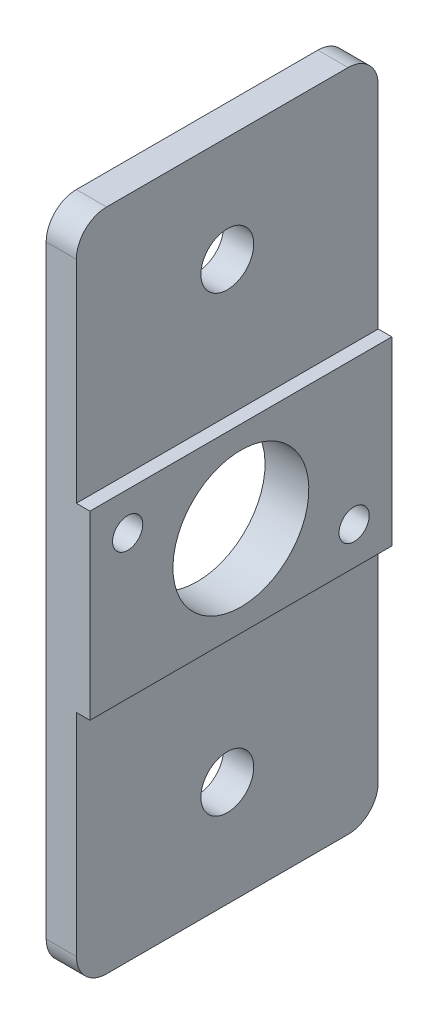
ISO-10303-21;
HEADER;
FILE_DESCRIPTION(('STEP AP214'),'2;1');
FILE_NAME('part.step','',(''),(''),'','','');
FILE_SCHEMA(('AUTOMOTIVE_DESIGN { 1 0 10303 214 1 1 1 1 }'));
ENDSEC;
DATA;
#1=APPLICATION_CONTEXT('core data for automotive mechanical design processes');
#2=APPLICATION_PROTOCOL_DEFINITION('international standard','automotive_design',2000,#1);
#3=PRODUCT_CONTEXT('',#1,'mechanical');
#4=PRODUCT('Part','Part','',(#3));
#5=PRODUCT_RELATED_PRODUCT_CATEGORY('part','',(#4));
#6=PRODUCT_DEFINITION_FORMATION('','',#4);
#7=PRODUCT_DEFINITION_CONTEXT('part definition',#1,'design');
#8=PRODUCT_DEFINITION('design','',#6,#7);
#9=PRODUCT_DEFINITION_SHAPE('','',#8);
#10=(LENGTH_UNIT() NAMED_UNIT(*) SI_UNIT(.MILLI.,.METRE.));
#11=(NAMED_UNIT(*) PLANE_ANGLE_UNIT() SI_UNIT($,.RADIAN.));
#12=(NAMED_UNIT(*) SI_UNIT($,.STERADIAN.) SOLID_ANGLE_UNIT());
#13=UNCERTAINTY_MEASURE_WITH_UNIT(LENGTH_MEASURE(1.E-05),#10,'distance_accuracy_value','');
#14=(GEOMETRIC_REPRESENTATION_CONTEXT(3) GLOBAL_UNCERTAINTY_ASSIGNED_CONTEXT((#13)) GLOBAL_UNIT_ASSIGNED_CONTEXT((#10,
#11,#12)) REPRESENTATION_CONTEXT('',''));
#15=CARTESIAN_POINT('',(0.,0.,0.));
#16=DIRECTION('',(0.,0.,1.));
#17=DIRECTION('',(1.,0.,0.));
#18=AXIS2_PLACEMENT_3D('',#15,#16,#17);
#19=CARTESIAN_POINT('',(2.,0.,20.));
#20=DIRECTION('',(0.,-1.,0.));
#21=DIRECTION('',(1.,0.,0.));
#22=AXIS2_PLACEMENT_3D('',#19,#20,#21);
#23=PLANE('',#22);
#24=DIRECTION('',(0.,0.,-1.));
#25=VECTOR('',#24,1.);
#26=CARTESIAN_POINT('',(2.,0.,20.));
#27=LINE('',#26,#25);
#28=CARTESIAN_POINT('',(2.,0.,18.));
#29=VERTEX_POINT('',#28);
#30=CARTESIAN_POINT('',(2.,0.,2.));
#31=VERTEX_POINT('',#30);
#32=EDGE_CURVE('E159',#29,#31,#27,.T.);
#33=ORIENTED_EDGE('',*,*,#32,.T.);
#34=DIRECTION('',(-1.,0.,0.));
#35=VECTOR('',#34,1.);
#36=CARTESIAN_POINT('',(2.,0.,2.));
#37=LINE('',#36,#35);
#38=CARTESIAN_POINT('',(0.,0.,2.));
#39=VERTEX_POINT('',#38);
#40=EDGE_CURVE('E222',#31,#39,#37,.T.);
#41=ORIENTED_EDGE('',*,*,#40,.T.);
#42=DIRECTION('',(0.,0.,-1.));
#43=VECTOR('',#42,1.);
#44=CARTESIAN_POINT('',(0.,0.,20.));
#45=LINE('',#44,#43);
#46=CARTESIAN_POINT('',(0.,0.,18.));
#47=VERTEX_POINT('',#46);
#48=EDGE_CURVE('E186',#47,#39,#45,.T.);
#49=ORIENTED_EDGE('',*,*,#48,.F.);
#50=DIRECTION('',(-1.,0.,0.));
#51=VECTOR('',#50,1.);
#52=CARTESIAN_POINT('',(2.,0.,18.));
#53=LINE('',#52,#51);
#54=EDGE_CURVE('E55',#47,#29,#53,.F.);
#55=ORIENTED_EDGE('',*,*,#54,.T.);
#56=EDGE_LOOP('',(#33,#41,#49,#55));
#57=FACE_BOUND('',#56,.T.);
#58=ADVANCED_FACE('F35',(#57),#23,.F.);
#59=CARTESIAN_POINT('',(0.,0.,20.));
#60=DIRECTION('',(1.,0.,0.));
#61=DIRECTION('',(0.,0.,-1.));
#62=AXIS2_PLACEMENT_3D('',#59,#60,#61);
#63=PLANE('',#62);
#64=CARTESIAN_POINT('',(0.,-22.,10.));
#65=DIRECTION('',(-1.,0.,0.));
#66=DIRECTION('',(0.,-1.,0.));
#67=AXIS2_PLACEMENT_3D('',#64,#65,#66);
#68=CIRCLE('',#67,4.5);
#69=CARTESIAN_POINT('',(0.,-26.5,10.));
#70=VERTEX_POINT('',#69);
#71=EDGE_CURVE('E261',#70,#70,#68,.T.);
#72=ORIENTED_EDGE('',*,*,#71,.F.);
#73=EDGE_LOOP('',(#72));
#74=FACE_BOUND('',#73,.T.);
#75=CARTESIAN_POINT('',(0.,-37.,10.));
#76=DIRECTION('',(-1.,0.,0.));
#77=DIRECTION('',(0.,-1.,0.));
#78=AXIS2_PLACEMENT_3D('',#75,#76,#77);
#79=CIRCLE('',#78,1.75);
#80=CARTESIAN_POINT('',(0.,-38.75,10.));
#81=VERTEX_POINT('',#80);
#82=EDGE_CURVE('E196',#81,#81,#79,.T.);
#83=ORIENTED_EDGE('',*,*,#82,.F.);
#84=EDGE_LOOP('',(#83));
#85=FACE_BOUND('',#84,.T.);
#86=CARTESIAN_POINT('',(0.,-7.,10.));
#87=DIRECTION('',(-1.,0.,0.));
#88=DIRECTION('',(0.,-1.,0.));
#89=AXIS2_PLACEMENT_3D('',#86,#87,#88);
#90=CIRCLE('',#89,1.75);
#91=CARTESIAN_POINT('',(0.,-8.75,10.));
#92=VERTEX_POINT('',#91);
#93=EDGE_CURVE('E192',#92,#92,#90,.T.);
#94=ORIENTED_EDGE('',*,*,#93,.F.);
#95=EDGE_LOOP('',(#94));
#96=FACE_BOUND('',#95,.T.);
#97=DIRECTION('',(0.,0.,-1.));
#98=VECTOR('',#97,1.);
#99=CARTESIAN_POINT('',(0.,-44.,20.));
#100=LINE('',#99,#98);
#101=CARTESIAN_POINT('',(0.,-44.,18.));
#102=VERTEX_POINT('',#101);
#103=CARTESIAN_POINT('',(0.,-44.,2.));
#104=VERTEX_POINT('',#103);
#105=EDGE_CURVE('E183',#102,#104,#100,.T.);
#106=ORIENTED_EDGE('',*,*,#105,.F.);
#107=CARTESIAN_POINT('',(0.,-42.,18.));
#108=DIRECTION('',(1.,0.,0.));
#109=DIRECTION('',(0.,0.,-1.));
#110=AXIS2_PLACEMENT_3D('',#107,#108,#109);
#111=CIRCLE('',#110,2.);
#112=CARTESIAN_POINT('',(0.,-42.,20.));
#113=VERTEX_POINT('',#112);
#114=EDGE_CURVE('E215',#102,#113,#111,.F.);
#115=ORIENTED_EDGE('',*,*,#114,.T.);
#116=DIRECTION('',(0.,-1.,0.));
#117=VECTOR('',#116,1.);
#118=CARTESIAN_POINT('',(0.,0.,20.));
#119=LINE('',#118,#117);
#120=CARTESIAN_POINT('',(0.,-2.,20.));
#121=VERTEX_POINT('',#120);
#122=EDGE_CURVE('E134',#121,#113,#119,.T.);
#123=ORIENTED_EDGE('',*,*,#122,.F.);
#124=CARTESIAN_POINT('',(0.,-2.,18.));
#125=DIRECTION('',(1.,0.,0.));
#126=DIRECTION('',(0.,0.,-1.));
#127=AXIS2_PLACEMENT_3D('',#124,#125,#126);
#128=CIRCLE('',#127,2.);
#129=EDGE_CURVE('E209',#121,#47,#128,.F.);
#130=ORIENTED_EDGE('',*,*,#129,.T.);
#131=ORIENTED_EDGE('',*,*,#48,.T.);
#132=CARTESIAN_POINT('',(0.,-2.,2.));
#133=DIRECTION('',(1.,0.,0.));
#134=DIRECTION('',(0.,0.,-1.));
#135=AXIS2_PLACEMENT_3D('',#132,#133,#134);
#136=CIRCLE('',#135,2.);
#137=CARTESIAN_POINT('',(0.,-2.,0.));
#138=VERTEX_POINT('',#137);
#139=EDGE_CURVE('E211',#39,#138,#136,.F.);
#140=ORIENTED_EDGE('',*,*,#139,.T.);
#141=DIRECTION('',(0.,-1.,0.));
#142=VECTOR('',#141,1.);
#143=CARTESIAN_POINT('',(0.,0.,0.));
#144=LINE('',#143,#142);
#145=CARTESIAN_POINT('',(0.,-42.,0.));
#146=VERTEX_POINT('',#145);
#147=EDGE_CURVE('E160',#138,#146,#144,.T.);
#148=ORIENTED_EDGE('',*,*,#147,.T.);
#149=CARTESIAN_POINT('',(0.,-42.,2.));
#150=DIRECTION('',(1.,0.,0.));
#151=DIRECTION('',(0.,0.,-1.));
#152=AXIS2_PLACEMENT_3D('',#149,#150,#151);
#153=CIRCLE('',#152,2.);
#154=EDGE_CURVE('E213',#146,#104,#153,.F.);
#155=ORIENTED_EDGE('',*,*,#154,.T.);
#156=EDGE_LOOP('',(#106,#115,#123,#130,#131,#140,#148,#155));
#157=FACE_BOUND('',#156,.T.);
#158=ADVANCED_FACE('F234',(#74,#85,#96,#157),#63,.F.);
#159=CARTESIAN_POINT('',(0.,-44.,20.));
#160=DIRECTION('',(0.,1.,0.));
#161=DIRECTION('',(0.,0.,1.));
#162=AXIS2_PLACEMENT_3D('',#159,#160,#161);
#163=PLANE('',#162);
#164=DIRECTION('',(0.,0.,-1.));
#165=VECTOR('',#164,1.);
#166=CARTESIAN_POINT('',(2.,-44.,20.));
#167=LINE('',#166,#165);
#168=CARTESIAN_POINT('',(2.,-44.,18.));
#169=VERTEX_POINT('',#168);
#170=CARTESIAN_POINT('',(2.,-44.,2.));
#171=VERTEX_POINT('',#170);
#172=EDGE_CURVE('E143',#169,#171,#167,.T.);
#173=ORIENTED_EDGE('',*,*,#172,.F.);
#174=DIRECTION('',(1.,0.,0.));
#175=VECTOR('',#174,1.);
#176=CARTESIAN_POINT('',(0.,-44.,18.));
#177=LINE('',#176,#175);
#178=EDGE_CURVE('E207',#169,#102,#177,.F.);
#179=ORIENTED_EDGE('',*,*,#178,.T.);
#180=ORIENTED_EDGE('',*,*,#105,.T.);
#181=DIRECTION('',(1.,0.,0.));
#182=VECTOR('',#181,1.);
#183=CARTESIAN_POINT('',(0.,-44.,2.));
#184=LINE('',#183,#182);
#185=EDGE_CURVE('E204',#104,#171,#184,.T.);
#186=ORIENTED_EDGE('',*,*,#185,.T.);
#187=EDGE_LOOP('',(#173,#179,#180,#186));
#188=FACE_BOUND('',#187,.T.);
#189=ADVANCED_FACE('F251',(#188),#163,.F.);
#190=CARTESIAN_POINT('',(2.,-44.,20.));
#191=DIRECTION('',(-1.,0.,0.));
#192=DIRECTION('',(0.,0.,1.));
#193=AXIS2_PLACEMENT_3D('',#190,#191,#192);
#194=PLANE('',#193);
#195=CARTESIAN_POINT('',(2.,-37.,10.));
#196=DIRECTION('',(-1.,0.,0.));
#197=DIRECTION('',(0.,0.,1.));
#198=AXIS2_PLACEMENT_3D('',#195,#196,#197);
#199=CIRCLE('',#198,1.75);
#200=CARTESIAN_POINT('',(2.,-37.,11.75));
#201=VERTEX_POINT('',#200);
#202=EDGE_CURVE('E193',#201,#201,#199,.T.);
#203=ORIENTED_EDGE('',*,*,#202,.T.);
#204=EDGE_LOOP('',(#203));
#205=FACE_BOUND('',#204,.T.);
#206=DIRECTION('',(0.,1.,0.));
#207=VECTOR('',#206,1.);
#208=CARTESIAN_POINT('',(2.,-44.,20.));
#209=LINE('',#208,#207);
#210=CARTESIAN_POINT('',(2.,-42.,20.));
#211=VERTEX_POINT('',#210);
#212=CARTESIAN_POINT('',(2.,-28.,20.));
#213=VERTEX_POINT('',#212);
#214=EDGE_CURVE('E124',#211,#213,#209,.T.);
#215=ORIENTED_EDGE('',*,*,#214,.F.);
#216=CARTESIAN_POINT('',(2.,-42.,18.));
#217=DIRECTION('',(-1.,0.,0.));
#218=DIRECTION('',(0.,0.,1.));
#219=AXIS2_PLACEMENT_3D('',#216,#217,#218);
#220=CIRCLE('',#219,2.);
#221=EDGE_CURVE('E202',#211,#169,#220,.F.);
#222=ORIENTED_EDGE('',*,*,#221,.T.);
#223=ORIENTED_EDGE('',*,*,#172,.T.);
#224=CARTESIAN_POINT('',(2.,-42.,2.));
#225=DIRECTION('',(-1.,0.,0.));
#226=DIRECTION('',(0.,0.,1.));
#227=AXIS2_PLACEMENT_3D('',#224,#225,#226);
#228=CIRCLE('',#227,2.);
#229=CARTESIAN_POINT('',(2.,-42.,0.));
#230=VERTEX_POINT('',#229);
#231=EDGE_CURVE('E200',#171,#230,#228,.F.);
#232=ORIENTED_EDGE('',*,*,#231,.T.);
#233=DIRECTION('',(0.,1.,0.));
#234=VECTOR('',#233,1.);
#235=CARTESIAN_POINT('',(2.,-44.,0.));
#236=LINE('',#235,#234);
#237=CARTESIAN_POINT('',(2.,-28.,0.));
#238=VERTEX_POINT('',#237);
#239=EDGE_CURVE('E140',#230,#238,#236,.T.);
#240=ORIENTED_EDGE('',*,*,#239,.T.);
#241=DIRECTION('',(0.,0.,-1.));
#242=VECTOR('',#241,1.);
#243=CARTESIAN_POINT('',(2.,-28.,20.));
#244=LINE('',#243,#242);
#245=EDGE_CURVE('E137',#213,#238,#244,.T.);
#246=ORIENTED_EDGE('',*,*,#245,.F.);
#247=EDGE_LOOP('',(#215,#222,#223,#232,#240,#246));
#248=FACE_BOUND('',#247,.T.);
#249=ADVANCED_FACE('F138',(#205,#248),#194,.F.);
#250=CARTESIAN_POINT('',(2.,-28.,20.));
#251=DIRECTION('',(0.,1.,0.));
#252=DIRECTION('',(0.,0.,1.));
#253=AXIS2_PLACEMENT_3D('',#250,#251,#252);
#254=PLANE('',#253);
#255=DIRECTION('',(1.,0.,0.));
#256=VECTOR('',#255,1.);
#257=CARTESIAN_POINT('',(2.,-28.,0.));
#258=LINE('',#257,#256);
#259=CARTESIAN_POINT('',(2.9,-28.,0.));
#260=VERTEX_POINT('',#259);
#261=EDGE_CURVE('E165',#238,#260,#258,.T.);
#262=ORIENTED_EDGE('',*,*,#261,.T.);
#263=DIRECTION('',(0.,0.,-1.));
#264=VECTOR('',#263,1.);
#265=CARTESIAN_POINT('',(2.9,-28.,20.));
#266=LINE('',#265,#264);
#267=CARTESIAN_POINT('',(2.9,-28.,20.));
#268=VERTEX_POINT('',#267);
#269=EDGE_CURVE('E144',#268,#260,#266,.T.);
#270=ORIENTED_EDGE('',*,*,#269,.F.);
#271=DIRECTION('',(1.,0.,0.));
#272=VECTOR('',#271,1.);
#273=CARTESIAN_POINT('',(2.,-28.,20.));
#274=LINE('',#273,#272);
#275=EDGE_CURVE('E129',#213,#268,#274,.T.);
#276=ORIENTED_EDGE('',*,*,#275,.F.);
#277=ORIENTED_EDGE('',*,*,#245,.T.);
#278=EDGE_LOOP('',(#262,#270,#276,#277));
#279=FACE_BOUND('',#278,.T.);
#280=ADVANCED_FACE('F146',(#279),#254,.F.);
#281=CARTESIAN_POINT('',(2.9,-28.,20.));
#282=DIRECTION('',(-1.,0.,0.));
#283=DIRECTION('',(0.,0.,1.));
#284=AXIS2_PLACEMENT_3D('',#281,#282,#283);
#285=PLANE('',#284);
#286=CARTESIAN_POINT('',(2.9,-25.5,2.5));
#287=DIRECTION('',(1.,0.,0.));
#288=DIRECTION('',(0.,1.,0.));
#289=AXIS2_PLACEMENT_3D('',#286,#287,#288);
#290=CIRCLE('',#289,1.);
#291=CARTESIAN_POINT('',(2.9,-24.5,2.5));
#292=VERTEX_POINT('',#291);
#293=EDGE_CURVE('E273',#292,#292,#290,.T.);
#294=ORIENTED_EDGE('',*,*,#293,.F.);
#295=EDGE_LOOP('',(#294));
#296=FACE_BOUND('',#295,.T.);
#297=CARTESIAN_POINT('',(2.9,-18.5,17.5));
#298=DIRECTION('',(1.,0.,0.));
#299=DIRECTION('',(0.,1.,0.));
#300=AXIS2_PLACEMENT_3D('',#297,#298,#299);
#301=CIRCLE('',#300,1.);
#302=CARTESIAN_POINT('',(2.9,-17.5,17.5));
#303=VERTEX_POINT('',#302);
#304=EDGE_CURVE('E267',#303,#303,#301,.T.);
#305=ORIENTED_EDGE('',*,*,#304,.F.);
#306=EDGE_LOOP('',(#305));
#307=FACE_BOUND('',#306,.T.);
#308=CARTESIAN_POINT('',(2.9,-22.,10.));
#309=DIRECTION('',(-1.,0.,0.));
#310=DIRECTION('',(0.,-1.,0.));
#311=AXIS2_PLACEMENT_3D('',#308,#309,#310);
#312=CIRCLE('',#311,4.5);
#313=CARTESIAN_POINT('',(2.9,-26.5,10.));
#314=VERTEX_POINT('',#313);
#315=EDGE_CURVE('E260',#314,#314,#312,.T.);
#316=ORIENTED_EDGE('',*,*,#315,.T.);
#317=EDGE_LOOP('',(#316));
#318=FACE_BOUND('',#317,.T.);
#319=DIRECTION('',(0.,1.,0.));
#320=VECTOR('',#319,1.);
#321=CARTESIAN_POINT('',(2.9,-28.,0.));
#322=LINE('',#321,#320);
#323=CARTESIAN_POINT('',(2.9,-16.,0.));
#324=VERTEX_POINT('',#323);
#325=EDGE_CURVE('E167',#260,#324,#322,.T.);
#326=ORIENTED_EDGE('',*,*,#325,.T.);
#327=DIRECTION('',(0.,0.,-1.));
#328=VECTOR('',#327,1.);
#329=CARTESIAN_POINT('',(2.9,-16.,20.));
#330=LINE('',#329,#328);
#331=CARTESIAN_POINT('',(2.9,-16.,20.));
#332=VERTEX_POINT('',#331);
#333=EDGE_CURVE('E177',#332,#324,#330,.T.);
#334=ORIENTED_EDGE('',*,*,#333,.F.);
#335=DIRECTION('',(0.,1.,0.));
#336=VECTOR('',#335,1.);
#337=CARTESIAN_POINT('',(2.9,-28.,20.));
#338=LINE('',#337,#336);
#339=EDGE_CURVE('E149',#268,#332,#338,.T.);
#340=ORIENTED_EDGE('',*,*,#339,.F.);
#341=ORIENTED_EDGE('',*,*,#269,.T.);
#342=EDGE_LOOP('',(#326,#334,#340,#341));
#343=FACE_BOUND('',#342,.T.);
#344=ADVANCED_FACE('F288',(#296,#307,#318,#343),#285,.F.);
#345=CARTESIAN_POINT('',(2.9,-16.,20.));
#346=DIRECTION('',(0.,-1.,0.));
#347=DIRECTION('',(0.,0.,-1.));
#348=AXIS2_PLACEMENT_3D('',#345,#346,#347);
#349=PLANE('',#348);
#350=DIRECTION('',(-1.,0.,0.));
#351=VECTOR('',#350,1.);
#352=CARTESIAN_POINT('',(2.9,-16.,0.));
#353=LINE('',#352,#351);
#354=CARTESIAN_POINT('',(2.,-16.,0.));
#355=VERTEX_POINT('',#354);
#356=EDGE_CURVE('E169',#324,#355,#353,.T.);
#357=ORIENTED_EDGE('',*,*,#356,.T.);
#358=DIRECTION('',(0.,0.,-1.));
#359=VECTOR('',#358,1.);
#360=CARTESIAN_POINT('',(2.,-16.,20.));
#361=LINE('',#360,#359);
#362=CARTESIAN_POINT('',(2.,-16.,20.));
#363=VERTEX_POINT('',#362);
#364=EDGE_CURVE('E174',#363,#355,#361,.T.);
#365=ORIENTED_EDGE('',*,*,#364,.F.);
#366=DIRECTION('',(-1.,0.,0.));
#367=VECTOR('',#366,1.);
#368=CARTESIAN_POINT('',(2.9,-16.,20.));
#369=LINE('',#368,#367);
#370=EDGE_CURVE('E151',#332,#363,#369,.T.);
#371=ORIENTED_EDGE('',*,*,#370,.F.);
#372=ORIENTED_EDGE('',*,*,#333,.T.);
#373=EDGE_LOOP('',(#357,#365,#371,#372));
#374=FACE_BOUND('',#373,.T.);
#375=ADVANCED_FACE('F291',(#374),#349,.F.);
#376=CARTESIAN_POINT('',(2.,-16.,20.));
#377=DIRECTION('',(-1.,0.,0.));
#378=DIRECTION('',(0.,0.,1.));
#379=AXIS2_PLACEMENT_3D('',#376,#377,#378);
#380=PLANE('',#379);
#381=CARTESIAN_POINT('',(2.,-7.,10.));
#382=DIRECTION('',(-1.,0.,0.));
#383=DIRECTION('',(0.,0.,1.));
#384=AXIS2_PLACEMENT_3D('',#381,#382,#383);
#385=CIRCLE('',#384,1.75);
#386=CARTESIAN_POINT('',(2.,-7.,11.75));
#387=VERTEX_POINT('',#386);
#388=EDGE_CURVE('E163',#387,#387,#385,.T.);
#389=ORIENTED_EDGE('',*,*,#388,.T.);
#390=EDGE_LOOP('',(#389));
#391=FACE_BOUND('',#390,.T.);
#392=DIRECTION('',(0.,1.,0.));
#393=VECTOR('',#392,1.);
#394=CARTESIAN_POINT('',(2.,-16.,0.));
#395=LINE('',#394,#393);
#396=CARTESIAN_POINT('',(2.,-2.,0.));
#397=VERTEX_POINT('',#396);
#398=EDGE_CURVE('E171',#355,#397,#395,.T.);
#399=ORIENTED_EDGE('',*,*,#398,.T.);
#400=CARTESIAN_POINT('',(2.,-2.,2.));
#401=DIRECTION('',(-1.,0.,0.));
#402=DIRECTION('',(0.,0.,1.));
#403=AXIS2_PLACEMENT_3D('',#400,#401,#402);
#404=CIRCLE('',#403,2.);
#405=EDGE_CURVE('E11',#397,#31,#404,.F.);
#406=ORIENTED_EDGE('',*,*,#405,.T.);
#407=ORIENTED_EDGE('',*,*,#32,.F.);
#408=CARTESIAN_POINT('',(2.,-2.,18.));
#409=DIRECTION('',(-1.,0.,0.));
#410=DIRECTION('',(0.,0.,1.));
#411=AXIS2_PLACEMENT_3D('',#408,#409,#410);
#412=CIRCLE('',#411,2.);
#413=CARTESIAN_POINT('',(2.,-2.,20.));
#414=VERTEX_POINT('',#413);
#415=EDGE_CURVE('E43',#29,#414,#412,.F.);
#416=ORIENTED_EDGE('',*,*,#415,.T.);
#417=DIRECTION('',(0.,1.,0.));
#418=VECTOR('',#417,1.);
#419=CARTESIAN_POINT('',(2.,-16.,20.));
#420=LINE('',#419,#418);
#421=EDGE_CURVE('E156',#363,#414,#420,.T.);
#422=ORIENTED_EDGE('',*,*,#421,.F.);
#423=ORIENTED_EDGE('',*,*,#364,.T.);
#424=EDGE_LOOP('',(#399,#406,#407,#416,#422,#423));
#425=FACE_BOUND('',#424,.T.);
#426=ADVANCED_FACE('F226',(#391,#425),#380,.F.);
#427=CARTESIAN_POINT('',(0.,0.,20.));
#428=DIRECTION('',(0.,0.,1.));
#429=DIRECTION('',(1.,0.,0.));
#430=AXIS2_PLACEMENT_3D('',#427,#428,#429);
#431=PLANE('',#430);
#432=ORIENTED_EDGE('',*,*,#122,.T.);
#433=DIRECTION('',(1.,0.,0.));
#434=VECTOR('',#433,1.);
#435=CARTESIAN_POINT('',(2.,-42.,20.));
#436=LINE('',#435,#434);
#437=EDGE_CURVE('E132',#113,#211,#436,.T.);
#438=ORIENTED_EDGE('',*,*,#437,.T.);
#439=ORIENTED_EDGE('',*,*,#214,.T.);
#440=ORIENTED_EDGE('',*,*,#275,.T.);
#441=ORIENTED_EDGE('',*,*,#339,.T.);
#442=ORIENTED_EDGE('',*,*,#370,.T.);
#443=ORIENTED_EDGE('',*,*,#421,.T.);
#444=DIRECTION('',(-1.,0.,0.));
#445=VECTOR('',#444,1.);
#446=CARTESIAN_POINT('',(0.,-2.,20.));
#447=LINE('',#446,#445);
#448=EDGE_CURVE('E189',#414,#121,#447,.T.);
#449=ORIENTED_EDGE('',*,*,#448,.T.);
#450=EDGE_LOOP('',(#432,#438,#439,#440,#441,#442,#443,#449));
#451=FACE_BOUND('',#450,.T.);
#452=ADVANCED_FACE('F127',(#451),#431,.T.);
#453=CARTESIAN_POINT('',(0.,0.,0.));
#454=DIRECTION('',(0.,0.,1.));
#455=DIRECTION('',(1.,0.,0.));
#456=AXIS2_PLACEMENT_3D('',#453,#454,#455);
#457=PLANE('',#456);
#458=ORIENTED_EDGE('',*,*,#239,.F.);
#459=DIRECTION('',(1.,0.,0.));
#460=VECTOR('',#459,1.);
#461=CARTESIAN_POINT('',(0.,-42.,0.));
#462=LINE('',#461,#460);
#463=EDGE_CURVE('E219',#230,#146,#462,.F.);
#464=ORIENTED_EDGE('',*,*,#463,.T.);
#465=ORIENTED_EDGE('',*,*,#147,.F.);
#466=DIRECTION('',(-1.,0.,0.));
#467=VECTOR('',#466,1.);
#468=CARTESIAN_POINT('',(0.,-2.,0.));
#469=LINE('',#468,#467);
#470=EDGE_CURVE('E217',#138,#397,#469,.F.);
#471=ORIENTED_EDGE('',*,*,#470,.T.);
#472=ORIENTED_EDGE('',*,*,#398,.F.);
#473=ORIENTED_EDGE('',*,*,#356,.F.);
#474=ORIENTED_EDGE('',*,*,#325,.F.);
#475=ORIENTED_EDGE('',*,*,#261,.F.);
#476=EDGE_LOOP('',(#458,#464,#465,#471,#472,#473,#474,#475));
#477=FACE_BOUND('',#476,.T.);
#478=ADVANCED_FACE('F242',(#477),#457,.F.);
#479=CARTESIAN_POINT('',(2.9,-7.,10.));
#480=DIRECTION('',(-1.,0.,0.));
#481=DIRECTION('',(0.,-1.,0.));
#482=AXIS2_PLACEMENT_3D('',#479,#480,#481);
#483=CYLINDRICAL_SURFACE('',#482,1.75);
#484=ORIENTED_EDGE('',*,*,#93,.T.);
#485=EDGE_LOOP('',(#484));
#486=FACE_BOUND('',#485,.T.);
#487=ORIENTED_EDGE('',*,*,#388,.F.);
#488=EDGE_LOOP('',(#487));
#489=FACE_BOUND('',#488,.T.);
#490=ADVANCED_FACE('F353',(#486,#489),#483,.F.);
#491=CARTESIAN_POINT('',(2.9,-37.,10.));
#492=DIRECTION('',(-1.,0.,0.));
#493=DIRECTION('',(0.,-1.,0.));
#494=AXIS2_PLACEMENT_3D('',#491,#492,#493);
#495=CYLINDRICAL_SURFACE('',#494,1.75);
#496=ORIENTED_EDGE('',*,*,#82,.T.);
#497=EDGE_LOOP('',(#496));
#498=FACE_BOUND('',#497,.T.);
#499=ORIENTED_EDGE('',*,*,#202,.F.);
#500=EDGE_LOOP('',(#499));
#501=FACE_BOUND('',#500,.T.);
#502=ADVANCED_FACE('F445',(#498,#501),#495,.F.);
#503=CARTESIAN_POINT('',(2.9,-22.,10.));
#504=DIRECTION('',(-1.,0.,0.));
#505=DIRECTION('',(0.,-1.,0.));
#506=AXIS2_PLACEMENT_3D('',#503,#504,#505);
#507=CYLINDRICAL_SURFACE('',#506,4.5);
#508=ORIENTED_EDGE('',*,*,#315,.F.);
#509=EDGE_LOOP('',(#508));
#510=FACE_BOUND('',#509,.T.);
#511=ORIENTED_EDGE('',*,*,#71,.T.);
#512=EDGE_LOOP('',(#511));
#513=FACE_BOUND('',#512,.T.);
#514=ADVANCED_FACE('F429',(#510,#513),#507,.F.);
#515=CARTESIAN_POINT('',(1.1,-18.5,17.5));
#516=DIRECTION('',(1.,0.,0.));
#517=DIRECTION('',(0.,1.,0.));
#518=AXIS2_PLACEMENT_3D('',#515,#516,#517);
#519=CYLINDRICAL_SURFACE('',#518,1.);
#520=CARTESIAN_POINT('',(1.1,-18.5,17.5));
#521=DIRECTION('',(1.,0.,0.));
#522=DIRECTION('',(0.,1.,0.));
#523=AXIS2_PLACEMENT_3D('',#520,#521,#522);
#524=CIRCLE('',#523,1.);
#525=CARTESIAN_POINT('',(1.1,-17.5,17.5));
#526=VERTEX_POINT('',#525);
#527=EDGE_CURVE('E264',#526,#526,#524,.T.);
#528=ORIENTED_EDGE('',*,*,#527,.F.);
#529=EDGE_LOOP('',(#528));
#530=FACE_BOUND('',#529,.T.);
#531=ORIENTED_EDGE('',*,*,#304,.T.);
#532=EDGE_LOOP('',(#531));
#533=FACE_BOUND('',#532,.T.);
#534=ADVANCED_FACE('F419',(#530,#533),#519,.F.);
#535=CARTESIAN_POINT('',(1.1,-18.5,17.5));
#536=DIRECTION('',(1.,0.,0.));
#537=DIRECTION('',(0.,1.,0.));
#538=AXIS2_PLACEMENT_3D('',#535,#536,#537);
#539=PLANE('',#538);
#540=ORIENTED_EDGE('',*,*,#527,.T.);
#541=EDGE_LOOP('',(#540));
#542=FACE_BOUND('',#541,.T.);
#543=ADVANCED_FACE('F284',(#542),#539,.T.);
#544=CARTESIAN_POINT('',(1.1,-25.5,2.5));
#545=DIRECTION('',(1.,0.,0.));
#546=DIRECTION('',(0.,1.,0.));
#547=AXIS2_PLACEMENT_3D('',#544,#545,#546);
#548=CYLINDRICAL_SURFACE('',#547,1.);
#549=CARTESIAN_POINT('',(1.1,-25.5,2.5));
#550=DIRECTION('',(1.,0.,0.));
#551=DIRECTION('',(0.,1.,0.));
#552=AXIS2_PLACEMENT_3D('',#549,#550,#551);
#553=CIRCLE('',#552,1.);
#554=CARTESIAN_POINT('',(1.1,-24.5,2.5));
#555=VERTEX_POINT('',#554);
#556=EDGE_CURVE('E270',#555,#555,#553,.T.);
#557=ORIENTED_EDGE('',*,*,#556,.F.);
#558=EDGE_LOOP('',(#557));
#559=FACE_BOUND('',#558,.T.);
#560=ORIENTED_EDGE('',*,*,#293,.T.);
#561=EDGE_LOOP('',(#560));
#562=FACE_BOUND('',#561,.T.);
#563=ADVANCED_FACE('F281',(#559,#562),#548,.F.);
#564=CARTESIAN_POINT('',(1.1,-25.5,2.5));
#565=DIRECTION('',(1.,0.,0.));
#566=DIRECTION('',(0.,1.,0.));
#567=AXIS2_PLACEMENT_3D('',#564,#565,#566);
#568=PLANE('',#567);
#569=ORIENTED_EDGE('',*,*,#556,.T.);
#570=EDGE_LOOP('',(#569));
#571=FACE_BOUND('',#570,.T.);
#572=ADVANCED_FACE('F279',(#571),#568,.T.);
#573=CARTESIAN_POINT('',(0.,-42.,18.));
#574=DIRECTION('',(-1.,0.,0.));
#575=DIRECTION('',(0.,0.,1.));
#576=AXIS2_PLACEMENT_3D('',#573,#574,#575);
#577=CYLINDRICAL_SURFACE('',#576,2.);
#578=ORIENTED_EDGE('',*,*,#114,.F.);
#579=ORIENTED_EDGE('',*,*,#178,.F.);
#580=ORIENTED_EDGE('',*,*,#221,.F.);
#581=ORIENTED_EDGE('',*,*,#437,.F.);
#582=EDGE_LOOP('',(#578,#579,#580,#581));
#583=FACE_BOUND('',#582,.T.);
#584=ADVANCED_FACE('F254',(#583),#577,.T.);
#585=CARTESIAN_POINT('',(0.,-42.,2.));
#586=DIRECTION('',(1.,0.,0.));
#587=DIRECTION('',(0.,0.,-1.));
#588=AXIS2_PLACEMENT_3D('',#585,#586,#587);
#589=CYLINDRICAL_SURFACE('',#588,2.);
#590=ORIENTED_EDGE('',*,*,#154,.F.);
#591=ORIENTED_EDGE('',*,*,#463,.F.);
#592=ORIENTED_EDGE('',*,*,#231,.F.);
#593=ORIENTED_EDGE('',*,*,#185,.F.);
#594=EDGE_LOOP('',(#590,#591,#592,#593));
#595=FACE_BOUND('',#594,.T.);
#596=ADVANCED_FACE('F246',(#595),#589,.T.);
#597=CARTESIAN_POINT('',(2.,-2.,2.));
#598=DIRECTION('',(-1.,0.,0.));
#599=DIRECTION('',(0.,-1.,0.));
#600=AXIS2_PLACEMENT_3D('',#597,#598,#599);
#601=CYLINDRICAL_SURFACE('',#600,2.);
#602=ORIENTED_EDGE('',*,*,#405,.F.);
#603=ORIENTED_EDGE('',*,*,#470,.F.);
#604=ORIENTED_EDGE('',*,*,#139,.F.);
#605=ORIENTED_EDGE('',*,*,#40,.F.);
#606=EDGE_LOOP('',(#602,#603,#604,#605));
#607=FACE_BOUND('',#606,.T.);
#608=ADVANCED_FACE('F237',(#607),#601,.T.);
#609=CARTESIAN_POINT('',(0.,-2.,18.));
#610=DIRECTION('',(1.,0.,0.));
#611=DIRECTION('',(0.,1.,0.));
#612=AXIS2_PLACEMENT_3D('',#609,#610,#611);
#613=CYLINDRICAL_SURFACE('',#612,2.);
#614=ORIENTED_EDGE('',*,*,#415,.F.);
#615=ORIENTED_EDGE('',*,*,#54,.F.);
#616=ORIENTED_EDGE('',*,*,#129,.F.);
#617=ORIENTED_EDGE('',*,*,#448,.F.);
#618=EDGE_LOOP('',(#614,#615,#616,#617));
#619=FACE_BOUND('',#618,.T.);
#620=ADVANCED_FACE('F37',(#619),#613,.T.);
#621=CLOSED_SHELL('',(#58,#158,#189,#249,#280,#344,#375,#426,#452,#478,#490,#502,#514,#534,#543,
#563,#572,#584,#596,#608,#620));
#622=MANIFOLD_SOLID_BREP('B2',#621);
#623=ADVANCED_BREP_SHAPE_REPRESENTATION('',(#18,#622),#14);
#624=SHAPE_DEFINITION_REPRESENTATION(#9,#623);
ENDSEC;
END-ISO-10303-21;
